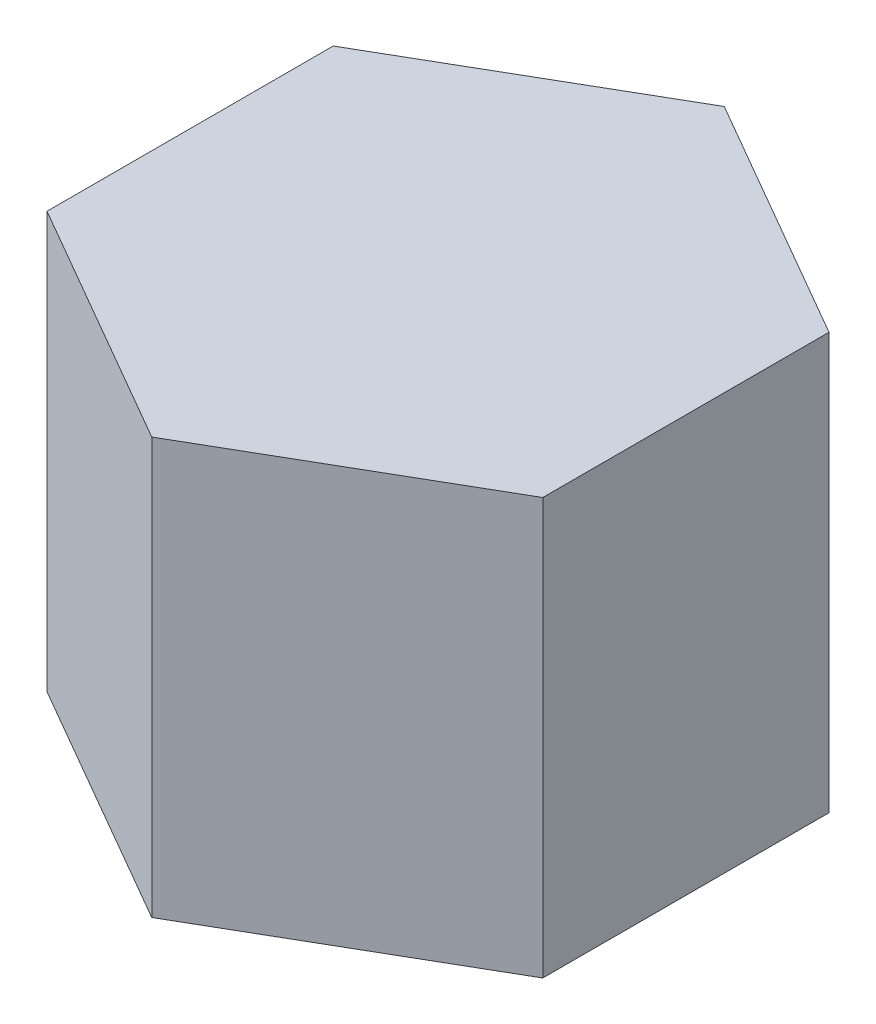
ISO-10303-21;
HEADER;
FILE_DESCRIPTION(('STEP AP214'),'2;1');
FILE_NAME('part.step','',(''),(''),'','','');
FILE_SCHEMA(('AUTOMOTIVE_DESIGN { 1 0 10303 214 1 1 1 1 }'));
ENDSEC;
DATA;
#1=APPLICATION_CONTEXT('core data for automotive mechanical design processes');
#2=APPLICATION_PROTOCOL_DEFINITION('international standard','automotive_design',2000,#1);
#3=PRODUCT_CONTEXT('',#1,'mechanical');
#4=PRODUCT('Part','Part','',(#3));
#5=PRODUCT_RELATED_PRODUCT_CATEGORY('part','',(#4));
#6=PRODUCT_DEFINITION_FORMATION('','',#4);
#7=PRODUCT_DEFINITION_CONTEXT('part definition',#1,'design');
#8=PRODUCT_DEFINITION('design','',#6,#7);
#9=PRODUCT_DEFINITION_SHAPE('','',#8);
#10=(LENGTH_UNIT() NAMED_UNIT(*) SI_UNIT(.MILLI.,.METRE.));
#11=(NAMED_UNIT(*) PLANE_ANGLE_UNIT() SI_UNIT($,.RADIAN.));
#12=(NAMED_UNIT(*) SI_UNIT($,.STERADIAN.) SOLID_ANGLE_UNIT());
#13=UNCERTAINTY_MEASURE_WITH_UNIT(LENGTH_MEASURE(1.E-05),#10,'distance_accuracy_value','');
#14=(GEOMETRIC_REPRESENTATION_CONTEXT(3) GLOBAL_UNCERTAINTY_ASSIGNED_CONTEXT((#13)) GLOBAL_UNIT_ASSIGNED_CONTEXT((#10,
#11,#12)) REPRESENTATION_CONTEXT('',''));
#15=CARTESIAN_POINT('',(0.,0.,0.));
#16=DIRECTION('',(0.,0.,1.));
#17=DIRECTION('',(1.,0.,0.));
#18=AXIS2_PLACEMENT_3D('',#15,#16,#17);
#19=CARTESIAN_POINT('',(202.839551417382,-147.556598747966,292.547996624279));
#20=DIRECTION('',(-0.500000000000096,0.,-0.866025403784383));
#21=DIRECTION('',(-0.866025403784383,0.,0.500000000000096));
#22=AXIS2_PLACEMENT_3D('',#19,#20,#21);
#23=PLANE('',#22);
#24=CARTESIAN_POINT('',(203.142660308706,-147.047793579175,292.372996624279));
#25=DIRECTION('',(-0.866025403784383,0.,0.500000000000096));
#26=VECTOR('',#25,1.);
#27=LINE('',#24,#26);
#28=CARTESIAN_POINT('',(203.142660308706,-147.047793579175,292.372996624279));
#29=VERTEX_POINT('',#28);
#30=CARTESIAN_POINT('',(202.839551417382,-147.047793579175,292.547996624279));
#31=VERTEX_POINT('',#30);
#32=EDGE_CURVE('E170',#29,#31,#27,.T.);
#33=ORIENTED_EDGE('',*,*,#32,.T.);
#34=CARTESIAN_POINT('',(202.839551417382,-147.556598747966,292.547996624279));
#35=DIRECTION('',(0.,1.,0.));
#36=VECTOR('',#35,1.);
#37=LINE('',#34,#36);
#38=CARTESIAN_POINT('',(202.839551417382,-147.556598747966,292.547996624279));
#39=VERTEX_POINT('',#38);
#40=EDGE_CURVE('E35',#39,#31,#37,.T.);
#41=ORIENTED_EDGE('',*,*,#40,.F.);
#42=CARTESIAN_POINT('',(203.142660308706,-147.556598747966,292.372996624279));
#43=DIRECTION('',(-0.866025403784383,0.,0.500000000000096));
#44=VECTOR('',#43,1.);
#45=LINE('',#42,#44);
#46=CARTESIAN_POINT('',(203.142660308706,-147.556598747966,292.372996624279));
#47=VERTEX_POINT('',#46);
#48=EDGE_CURVE('E159',#47,#39,#45,.T.);
#49=ORIENTED_EDGE('',*,*,#48,.F.);
#50=CARTESIAN_POINT('',(203.142660308706,-147.556598747966,292.372996624279));
#51=DIRECTION('',(0.,1.,0.));
#52=VECTOR('',#51,1.);
#53=LINE('',#50,#52);
#54=EDGE_CURVE('E10',#47,#29,#53,.T.);
#55=ORIENTED_EDGE('',*,*,#54,.T.);
#56=EDGE_LOOP('',(#33,#41,#49,#55));
#57=FACE_BOUND('',#56,.T.);
#58=ADVANCED_FACE('F16',(#57),#23,.F.);
#59=CARTESIAN_POINT('',(203.142660308706,-147.556598747966,291.594471220494));
#60=DIRECTION('',(-1.,0.,0.));
#61=DIRECTION('',(0.,-1.,0.));
#62=AXIS2_PLACEMENT_3D('',#59,#60,#61);
#63=PLANE('',#62);
#64=CARTESIAN_POINT('',(203.142660308706,-147.047793579175,292.022996624279));
#65=DIRECTION('',(0.,0.,1.));
#66=VECTOR('',#65,1.);
#67=LINE('',#64,#66);
#68=CARTESIAN_POINT('',(203.142660308706,-147.047793579175,292.022996624279));
#69=VERTEX_POINT('',#68);
#70=EDGE_CURVE('E167',#69,#29,#67,.T.);
#71=ORIENTED_EDGE('',*,*,#70,.T.);
#72=ORIENTED_EDGE('',*,*,#54,.F.);
#73=CARTESIAN_POINT('',(203.142660308706,-147.556598747966,292.022996624279));
#74=DIRECTION('',(0.,0.,1.));
#75=VECTOR('',#74,1.);
#76=LINE('',#73,#75);
#77=CARTESIAN_POINT('',(203.142660308706,-147.556598747966,292.022996624279));
#78=VERTEX_POINT('',#77);
#79=EDGE_CURVE('E156',#78,#47,#76,.T.);
#80=ORIENTED_EDGE('',*,*,#79,.F.);
#81=CARTESIAN_POINT('',(203.142660308706,-147.556598747966,292.022996624279));
#82=DIRECTION('',(0.,1.,0.));
#83=VECTOR('',#82,1.);
#84=LINE('',#81,#83);
#85=EDGE_CURVE('E27',#78,#69,#84,.T.);
#86=ORIENTED_EDGE('',*,*,#85,.T.);
#87=EDGE_LOOP('',(#71,#72,#80,#86));
#88=FACE_BOUND('',#87,.T.);
#89=ADVANCED_FACE('F189',(#88),#63,.F.);
#90=CARTESIAN_POINT('',(203.142660308706,-147.556598747966,292.022996624279));
#91=DIRECTION('',(-0.499999999999909,0.,0.866025403784491));
#92=DIRECTION('',(0.866025403784491,0.,0.499999999999909));
#93=AXIS2_PLACEMENT_3D('',#90,#91,#92);
#94=PLANE('',#93);
#95=CARTESIAN_POINT('',(202.839551417381,-147.047793579175,291.847996624279));
#96=DIRECTION('',(0.866025403784491,0.,0.499999999999909));
#97=VECTOR('',#96,1.);
#98=LINE('',#95,#97);
#99=CARTESIAN_POINT('',(202.839551417382,-147.047793579175,291.847996624279));
#100=VERTEX_POINT('',#99);
#101=EDGE_CURVE('E163',#100,#69,#98,.T.);
#102=ORIENTED_EDGE('',*,*,#101,.T.);
#103=ORIENTED_EDGE('',*,*,#85,.F.);
#104=CARTESIAN_POINT('',(202.839551417381,-147.556598747966,291.847996624279));
#105=DIRECTION('',(0.866025403784491,0.,0.499999999999909));
#106=VECTOR('',#105,1.);
#107=LINE('',#104,#106);
#108=CARTESIAN_POINT('',(202.839551417382,-147.556598747966,291.847996624279));
#109=VERTEX_POINT('',#108);
#110=EDGE_CURVE('E106',#109,#78,#107,.T.);
#111=ORIENTED_EDGE('',*,*,#110,.F.);
#112=CARTESIAN_POINT('',(202.839551417381,-147.556598747966,291.847996624279));
#113=DIRECTION('',(0.,1.,0.));
#114=VECTOR('',#113,1.);
#115=LINE('',#112,#114);
#116=EDGE_CURVE('E94',#109,#100,#115,.T.);
#117=ORIENTED_EDGE('',*,*,#116,.T.);
#118=EDGE_LOOP('',(#102,#103,#111,#117));
#119=FACE_BOUND('',#118,.T.);
#120=ADVANCED_FACE('F198',(#119),#94,.F.);
#121=CARTESIAN_POINT('',(202.839551417382,-147.556598747966,291.847996624279));
#122=DIRECTION('',(0.500000000000096,0.,0.866025403784383));
#123=DIRECTION('',(0.866025403784383,0.,-0.500000000000096));
#124=AXIS2_PLACEMENT_3D('',#121,#122,#123);
#125=PLANE('',#124);
#126=CARTESIAN_POINT('',(202.536442526057,-147.047793579175,292.022996624279));
#127=DIRECTION('',(0.866025403784383,0.,-0.500000000000096));
#128=VECTOR('',#127,1.);
#129=LINE('',#126,#128);
#130=CARTESIAN_POINT('',(202.536442526057,-147.047793579175,292.022996624279));
#131=VERTEX_POINT('',#130);
#132=EDGE_CURVE('E162',#131,#100,#129,.T.);
#133=ORIENTED_EDGE('',*,*,#132,.T.);
#134=ORIENTED_EDGE('',*,*,#116,.F.);
#135=CARTESIAN_POINT('',(202.536442526057,-147.556598747966,292.022996624279));
#136=DIRECTION('',(0.866025403784383,0.,-0.500000000000096));
#137=VECTOR('',#136,1.);
#138=LINE('',#135,#137);
#139=CARTESIAN_POINT('',(202.536442526057,-147.556598747966,292.022996624279));
#140=VERTEX_POINT('',#139);
#141=EDGE_CURVE('E98',#140,#109,#138,.T.);
#142=ORIENTED_EDGE('',*,*,#141,.F.);
#143=CARTESIAN_POINT('',(202.536442526057,-147.556598747966,292.022996624279));
#144=DIRECTION('',(0.,1.,0.));
#145=VECTOR('',#144,1.);
#146=LINE('',#143,#145);
#147=EDGE_CURVE('E79',#140,#131,#146,.T.);
#148=ORIENTED_EDGE('',*,*,#147,.T.);
#149=EDGE_LOOP('',(#133,#134,#142,#148));
#150=FACE_BOUND('',#149,.T.);
#151=ADVANCED_FACE('F100',(#150),#125,.F.);
#152=CARTESIAN_POINT('',(202.536442526057,-147.556598747966,291.594471220494));
#153=DIRECTION('',(1.,0.,0.));
#154=DIRECTION('',(0.,1.,0.));
#155=AXIS2_PLACEMENT_3D('',#152,#153,#154);
#156=PLANE('',#155);
#157=CARTESIAN_POINT('',(202.536442526057,-147.047793579175,292.372996624279));
#158=DIRECTION('',(0.,0.,-1.));
#159=VECTOR('',#158,1.);
#160=LINE('',#157,#159);
#161=CARTESIAN_POINT('',(202.536442526057,-147.047793579175,292.372996624279));
#162=VERTEX_POINT('',#161);
#163=EDGE_CURVE('E88',#162,#131,#160,.T.);
#164=ORIENTED_EDGE('',*,*,#163,.T.);
#165=ORIENTED_EDGE('',*,*,#147,.F.);
#166=CARTESIAN_POINT('',(202.536442526057,-147.556598747966,292.372996624279));
#167=DIRECTION('',(0.,0.,-1.));
#168=VECTOR('',#167,1.);
#169=LINE('',#166,#168);
#170=CARTESIAN_POINT('',(202.536442526057,-147.556598747966,292.372996624279));
#171=VERTEX_POINT('',#170);
#172=EDGE_CURVE('E84',#171,#140,#169,.T.);
#173=ORIENTED_EDGE('',*,*,#172,.F.);
#174=CARTESIAN_POINT('',(202.536442526057,-147.556598747966,292.372996624279));
#175=DIRECTION('',(0.,1.,0.));
#176=VECTOR('',#175,1.);
#177=LINE('',#174,#176);
#178=EDGE_CURVE('E58',#171,#162,#177,.T.);
#179=ORIENTED_EDGE('',*,*,#178,.T.);
#180=EDGE_LOOP('',(#164,#165,#173,#179));
#181=FACE_BOUND('',#180,.T.);
#182=ADVANCED_FACE('F82',(#181),#156,.F.);
#183=CARTESIAN_POINT('',(202.536442526057,-147.556598747966,292.372996624279));
#184=DIRECTION('',(0.499999999999978,0.,-0.866025403784452));
#185=DIRECTION('',(-0.866025403784452,0.,-0.499999999999978));
#186=AXIS2_PLACEMENT_3D('',#183,#184,#185);
#187=PLANE('',#186);
#188=CARTESIAN_POINT('',(202.839551417382,-147.047793579175,292.547996624279));
#189=DIRECTION('',(-0.866025403784452,0.,-0.499999999999978));
#190=VECTOR('',#189,1.);
#191=LINE('',#188,#190);
#192=EDGE_CURVE('E160',#31,#162,#191,.T.);
#193=ORIENTED_EDGE('',*,*,#192,.T.);
#194=ORIENTED_EDGE('',*,*,#178,.F.);
#195=CARTESIAN_POINT('',(202.839551417382,-147.556598747966,292.547996624279));
#196=DIRECTION('',(-0.866025403784452,0.,-0.499999999999978));
#197=VECTOR('',#196,1.);
#198=LINE('',#195,#197);
#199=EDGE_CURVE('E112',#39,#171,#198,.T.);
#200=ORIENTED_EDGE('',*,*,#199,.F.);
#201=ORIENTED_EDGE('',*,*,#40,.T.);
#202=EDGE_LOOP('',(#193,#194,#200,#201));
#203=FACE_BOUND('',#202,.T.);
#204=ADVANCED_FACE('F131',(#203),#187,.F.);
#205=CARTESIAN_POINT('',(206.491105863044,-147.556598747966,291.594471220494));
#206=DIRECTION('',(0.,1.,0.));
#207=DIRECTION('',(-1.,0.,0.));
#208=AXIS2_PLACEMENT_3D('',#205,#206,#207);
#209=PLANE('',#208);
#210=ORIENTED_EDGE('',*,*,#48,.T.);
#211=ORIENTED_EDGE('',*,*,#199,.T.);
#212=ORIENTED_EDGE('',*,*,#172,.T.);
#213=ORIENTED_EDGE('',*,*,#141,.T.);
#214=ORIENTED_EDGE('',*,*,#110,.T.);
#215=ORIENTED_EDGE('',*,*,#79,.T.);
#216=EDGE_LOOP('',(#210,#211,#212,#213,#214,#215));
#217=FACE_BOUND('',#216,.T.);
#218=ADVANCED_FACE('F111',(#217),#209,.F.);
#219=CARTESIAN_POINT('',(206.491105863044,-147.047793579175,291.594471220494));
#220=DIRECTION('',(0.,1.,0.));
#221=DIRECTION('',(-1.,0.,0.));
#222=AXIS2_PLACEMENT_3D('',#219,#220,#221);
#223=PLANE('',#222);
#224=ORIENTED_EDGE('',*,*,#32,.F.);
#225=ORIENTED_EDGE('',*,*,#70,.F.);
#226=ORIENTED_EDGE('',*,*,#101,.F.);
#227=ORIENTED_EDGE('',*,*,#132,.F.);
#228=ORIENTED_EDGE('',*,*,#163,.F.);
#229=ORIENTED_EDGE('',*,*,#192,.F.);
#230=EDGE_LOOP('',(#224,#225,#226,#227,#228,#229));
#231=FACE_BOUND('',#230,.T.);
#232=ADVANCED_FACE('F130',(#231),#223,.T.);
#233=CLOSED_SHELL('',(#58,#89,#120,#151,#182,#204,#218,#232));
#234=MANIFOLD_SOLID_BREP('B1',#233);
#235=ADVANCED_BREP_SHAPE_REPRESENTATION('',(#18,#234),#14);
#236=SHAPE_DEFINITION_REPRESENTATION(#9,#235);
ENDSEC;
END-ISO-10303-21;
